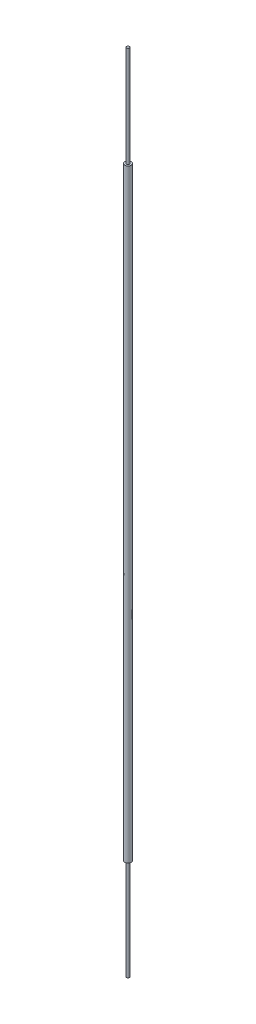
ISO-10303-21;
HEADER;
FILE_DESCRIPTION(('STEP AP214'),'2;1');
FILE_NAME('part.step','',(''),(''),'','','');
FILE_SCHEMA(('AUTOMOTIVE_DESIGN { 1 0 10303 214 1 1 1 1 }'));
ENDSEC;
DATA;
#1=APPLICATION_CONTEXT('core data for automotive mechanical design processes');
#2=APPLICATION_PROTOCOL_DEFINITION('international standard','automotive_design',2000,#1);
#3=PRODUCT_CONTEXT('',#1,'mechanical');
#4=PRODUCT('Part','Part','',(#3));
#5=PRODUCT_RELATED_PRODUCT_CATEGORY('part','',(#4));
#6=PRODUCT_DEFINITION_FORMATION('','',#4);
#7=PRODUCT_DEFINITION_CONTEXT('part definition',#1,'design');
#8=PRODUCT_DEFINITION('design','',#6,#7);
#9=PRODUCT_DEFINITION_SHAPE('','',#8);
#10=(LENGTH_UNIT() NAMED_UNIT(*) SI_UNIT(.MILLI.,.METRE.));
#11=(NAMED_UNIT(*) PLANE_ANGLE_UNIT() SI_UNIT($,.RADIAN.));
#12=(NAMED_UNIT(*) SI_UNIT($,.STERADIAN.) SOLID_ANGLE_UNIT());
#13=UNCERTAINTY_MEASURE_WITH_UNIT(LENGTH_MEASURE(1.E-05),#10,'distance_accuracy_value','');
#14=(GEOMETRIC_REPRESENTATION_CONTEXT(3) GLOBAL_UNCERTAINTY_ASSIGNED_CONTEXT((#13)) GLOBAL_UNIT_ASSIGNED_CONTEXT((#10,
#11,#12)) REPRESENTATION_CONTEXT('',''));
#15=CARTESIAN_POINT('',(0.,0.,0.));
#16=DIRECTION('',(0.,0.,1.));
#17=DIRECTION('',(1.,0.,0.));
#18=AXIS2_PLACEMENT_3D('',#15,#16,#17);
#19=CARTESIAN_POINT('',(0.,-11.,0.));
#20=DIRECTION('',(0.,1.,0.));
#21=DIRECTION('',(0.,0.,1.));
#22=AXIS2_PLACEMENT_3D('',#19,#20,#21);
#23=CYLINDRICAL_SURFACE('',#22,0.06985);
#24=CARTESIAN_POINT('',(0.,-11.,0.));
#25=DIRECTION('',(0.,1.,0.));
#26=DIRECTION('',(0.,0.,1.));
#27=AXIS2_PLACEMENT_3D('',#24,#25,#26);
#28=CIRCLE('',#27,0.06985);
#29=CARTESIAN_POINT('',(0.,-11.,0.06985));
#30=VERTEX_POINT('',#29);
#31=EDGE_CURVE('E12',#30,#30,#28,.T.);
#32=ORIENTED_EDGE('',*,*,#31,.T.);
#33=EDGE_LOOP('',(#32));
#34=FACE_BOUND('',#33,.T.);
#35=CARTESIAN_POINT('',(0.,29.,0.));
#36=DIRECTION('',(0.,1.,0.));
#37=DIRECTION('',(0.,0.,1.));
#38=AXIS2_PLACEMENT_3D('',#35,#36,#37);
#39=CIRCLE('',#38,0.06985);
#40=CARTESIAN_POINT('',(0.,29.,0.06985));
#41=VERTEX_POINT('',#40);
#42=EDGE_CURVE('E60',#41,#41,#39,.T.);
#43=ORIENTED_EDGE('',*,*,#42,.F.);
#44=EDGE_LOOP('',(#43));
#45=FACE_BOUND('',#44,.T.);
#46=ADVANCED_FACE('F57',(#34,#45),#23,.T.);
#47=CARTESIAN_POINT('',(0.,-11.,0.));
#48=DIRECTION('',(0.,1.,0.));
#49=DIRECTION('',(0.,0.,1.));
#50=AXIS2_PLACEMENT_3D('',#47,#48,#49);
#51=PLANE('',#50);
#52=ORIENTED_EDGE('',*,*,#31,.F.);
#53=EDGE_LOOP('',(#52));
#54=FACE_BOUND('',#53,.T.);
#55=ADVANCED_FACE('F72',(#54),#51,.F.);
#56=CARTESIAN_POINT('',(0.,29.,0.));
#57=DIRECTION('',(0.,1.,0.));
#58=DIRECTION('',(0.,0.,1.));
#59=AXIS2_PLACEMENT_3D('',#56,#57,#58);
#60=PLANE('',#59);
#61=ORIENTED_EDGE('',*,*,#42,.T.);
#62=EDGE_LOOP('',(#61));
#63=FACE_BOUND('',#62,.T.);
#64=ADVANCED_FACE('F69',(#63),#60,.T.);
#65=CLOSED_SHELL('',(#46,#55,#64));
#66=MANIFOLD_SOLID_BREP('B2',#65);
#67=CARTESIAN_POINT('',(0.,-6.,0.));
#68=DIRECTION('',(0.,1.,0.));
#69=DIRECTION('',(0.,0.,1.));
#70=AXIS2_PLACEMENT_3D('',#67,#68,#69);
#71=PLANE('',#70);
#72=CARTESIAN_POINT('',(0.,-6.,0.));
#73=DIRECTION('',(0.,1.,0.));
#74=DIRECTION('',(0.,0.,1.));
#75=AXIS2_PLACEMENT_3D('',#72,#73,#74);
#76=CIRCLE('',#75,0.0762);
#77=CARTESIAN_POINT('',(0.,-6.,0.0762));
#78=VERTEX_POINT('',#77);
#79=EDGE_CURVE('E111',#78,#78,#76,.T.);
#80=ORIENTED_EDGE('',*,*,#79,.T.);
#81=EDGE_LOOP('',(#80));
#82=FACE_BOUND('',#81,.T.);
#83=CARTESIAN_POINT('',(0.,-6.,0.));
#84=DIRECTION('',(0.,1.,0.));
#85=DIRECTION('',(0.,0.,1.));
#86=AXIS2_PLACEMENT_3D('',#83,#84,#85);
#87=CIRCLE('',#86,0.15875);
#88=CARTESIAN_POINT('',(0.,-6.,0.15875));
#89=VERTEX_POINT('',#88);
#90=EDGE_CURVE('E101',#89,#89,#87,.T.);
#91=ORIENTED_EDGE('',*,*,#90,.F.);
#92=EDGE_LOOP('',(#91));
#93=FACE_BOUND('',#92,.T.);
#94=ADVANCED_FACE('F97',(#82,#93),#71,.F.);
#95=CARTESIAN_POINT('',(0.,24.,0.));
#96=DIRECTION('',(0.,1.,0.));
#97=DIRECTION('',(0.,0.,1.));
#98=AXIS2_PLACEMENT_3D('',#95,#96,#97);
#99=PLANE('',#98);
#100=CARTESIAN_POINT('',(0.,24.,0.));
#101=DIRECTION('',(0.,1.,0.));
#102=DIRECTION('',(0.,0.,1.));
#103=AXIS2_PLACEMENT_3D('',#100,#101,#102);
#104=CIRCLE('',#103,0.0762);
#105=CARTESIAN_POINT('',(0.,24.,0.0762));
#106=VERTEX_POINT('',#105);
#107=EDGE_CURVE('E105',#106,#106,#104,.T.);
#108=ORIENTED_EDGE('',*,*,#107,.F.);
#109=EDGE_LOOP('',(#108));
#110=FACE_BOUND('',#109,.T.);
#111=CARTESIAN_POINT('',(0.,24.,0.));
#112=DIRECTION('',(0.,1.,0.));
#113=DIRECTION('',(0.,0.,1.));
#114=AXIS2_PLACEMENT_3D('',#111,#112,#113);
#115=CIRCLE('',#114,0.15875);
#116=CARTESIAN_POINT('',(0.,24.,0.15875));
#117=VERTEX_POINT('',#116);
#118=EDGE_CURVE('E56',#117,#117,#115,.T.);
#119=ORIENTED_EDGE('',*,*,#118,.T.);
#120=EDGE_LOOP('',(#119));
#121=FACE_BOUND('',#120,.T.);
#122=ADVANCED_FACE('F121',(#110,#121),#99,.T.);
#123=CARTESIAN_POINT('',(0.,24.,0.));
#124=DIRECTION('',(0.,-1.,0.));
#125=DIRECTION('',(1.,0.,0.));
#126=AXIS2_PLACEMENT_3D('',#123,#124,#125);
#127=CYLINDRICAL_SURFACE('',#126,0.15875);
#128=ORIENTED_EDGE('',*,*,#118,.F.);
#129=EDGE_LOOP('',(#128));
#130=FACE_BOUND('',#129,.T.);
#131=ORIENTED_EDGE('',*,*,#90,.T.);
#132=EDGE_LOOP('',(#131));
#133=FACE_BOUND('',#132,.T.);
#134=ADVANCED_FACE('F118',(#130,#133),#127,.T.);
#135=CARTESIAN_POINT('',(0.,24.,0.));
#136=DIRECTION('',(0.,-1.,0.));
#137=DIRECTION('',(1.,0.,0.));
#138=AXIS2_PLACEMENT_3D('',#135,#136,#137);
#139=CYLINDRICAL_SURFACE('',#138,0.0762);
#140=ORIENTED_EDGE('',*,*,#107,.T.);
#141=EDGE_LOOP('',(#140));
#142=FACE_BOUND('',#141,.T.);
#143=ORIENTED_EDGE('',*,*,#79,.F.);
#144=EDGE_LOOP('',(#143));
#145=FACE_BOUND('',#144,.T.);
#146=ADVANCED_FACE('F99',(#142,#145),#139,.F.);
#147=CLOSED_SHELL('',(#94,#122,#134,#146));
#148=MANIFOLD_SOLID_BREP('B7',#147);
#149=ADVANCED_BREP_SHAPE_REPRESENTATION('',(#18,#66,#148),#14);
#150=SHAPE_DEFINITION_REPRESENTATION(#9,#149);
ENDSEC;
END-ISO-10303-21;
